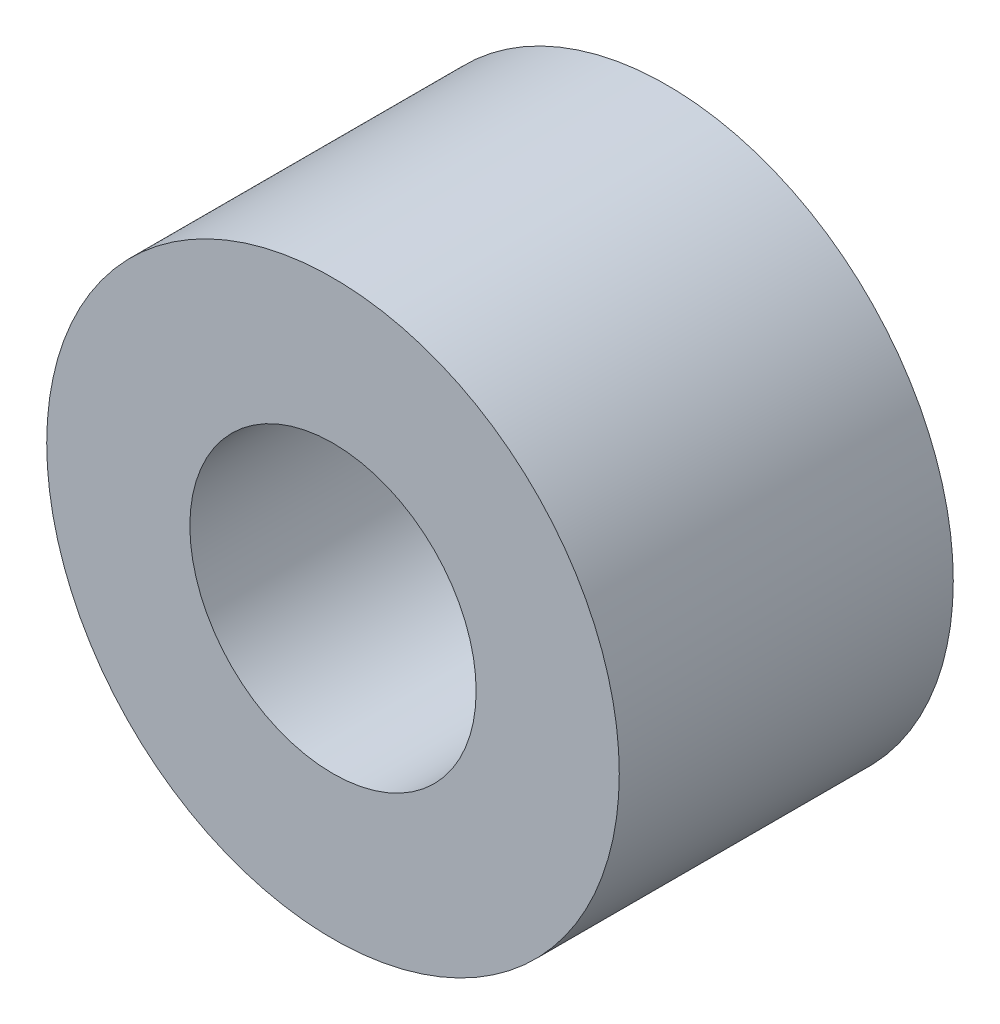
ISO-10303-21;
HEADER;
FILE_DESCRIPTION(('STEP AP214'),'2;1');
FILE_NAME('part.step','',(''),(''),'','','');
FILE_SCHEMA(('AUTOMOTIVE_DESIGN { 1 0 10303 214 1 1 1 1 }'));
ENDSEC;
DATA;
#1=APPLICATION_CONTEXT('core data for automotive mechanical design processes');
#2=APPLICATION_PROTOCOL_DEFINITION('international standard','automotive_design',2000,#1);
#3=PRODUCT_CONTEXT('',#1,'mechanical');
#4=PRODUCT('Part','Part','',(#3));
#5=PRODUCT_RELATED_PRODUCT_CATEGORY('part','',(#4));
#6=PRODUCT_DEFINITION_FORMATION('','',#4);
#7=PRODUCT_DEFINITION_CONTEXT('part definition',#1,'design');
#8=PRODUCT_DEFINITION('design','',#6,#7);
#9=PRODUCT_DEFINITION_SHAPE('','',#8);
#10=(LENGTH_UNIT() NAMED_UNIT(*) SI_UNIT(.MILLI.,.METRE.));
#11=(NAMED_UNIT(*) PLANE_ANGLE_UNIT() SI_UNIT($,.RADIAN.));
#12=(NAMED_UNIT(*) SI_UNIT($,.STERADIAN.) SOLID_ANGLE_UNIT());
#13=UNCERTAINTY_MEASURE_WITH_UNIT(LENGTH_MEASURE(1.E-05),#10,'distance_accuracy_value','');
#14=(GEOMETRIC_REPRESENTATION_CONTEXT(3) GLOBAL_UNCERTAINTY_ASSIGNED_CONTEXT((#13)) GLOBAL_UNIT_ASSIGNED_CONTEXT((#10,
#11,#12)) REPRESENTATION_CONTEXT('',''));
#15=CARTESIAN_POINT('',(0.,0.,0.));
#16=DIRECTION('',(0.,0.,1.));
#17=DIRECTION('',(1.,0.,0.));
#18=AXIS2_PLACEMENT_3D('',#15,#16,#17);
#19=CARTESIAN_POINT('',(7.99999999999999,30.,10.));
#20=DIRECTION('',(0.,0.,1.));
#21=DIRECTION('',(1.,0.,0.));
#22=AXIS2_PLACEMENT_3D('',#19,#20,#21);
#23=PLANE('',#22);
#24=CARTESIAN_POINT('',(7.99999999999999,30.,10.));
#25=DIRECTION('',(0.,0.,1.));
#26=DIRECTION('',(1.,0.,0.));
#27=AXIS2_PLACEMENT_3D('',#24,#25,#26);
#28=CIRCLE('',#27,6.00000000000001);
#29=CARTESIAN_POINT('',(14.,30.,10.));
#30=VERTEX_POINT('',#29);
#31=EDGE_CURVE('E10',#30,#30,#28,.T.);
#32=ORIENTED_EDGE('',*,*,#31,.T.);
#33=EDGE_LOOP('',(#32));
#34=FACE_BOUND('',#33,.T.);
#35=CARTESIAN_POINT('',(7.99999999999999,30.,10.));
#36=DIRECTION('',(0.,0.,1.));
#37=DIRECTION('',(1.,0.,0.));
#38=AXIS2_PLACEMENT_3D('',#35,#36,#37);
#39=CIRCLE('',#38,3.);
#40=CARTESIAN_POINT('',(11.,30.,10.));
#41=VERTEX_POINT('',#40);
#42=EDGE_CURVE('E46',#41,#41,#39,.T.);
#43=ORIENTED_EDGE('',*,*,#42,.F.);
#44=EDGE_LOOP('',(#43));
#45=FACE_BOUND('',#44,.T.);
#46=ADVANCED_FACE('F35',(#34,#45),#23,.T.);
#47=CARTESIAN_POINT('',(7.99999999999999,30.,3.));
#48=DIRECTION('',(0.,0.,1.));
#49=DIRECTION('',(1.,0.,0.));
#50=AXIS2_PLACEMENT_3D('',#47,#48,#49);
#51=PLANE('',#50);
#52=CARTESIAN_POINT('',(7.99999999999999,30.,3.));
#53=DIRECTION('',(0.,0.,1.));
#54=DIRECTION('',(1.,0.,0.));
#55=AXIS2_PLACEMENT_3D('',#52,#53,#54);
#56=CIRCLE('',#55,6.00000000000001);
#57=CARTESIAN_POINT('',(14.,30.,3.));
#58=VERTEX_POINT('',#57);
#59=EDGE_CURVE('E39',#58,#58,#56,.T.);
#60=ORIENTED_EDGE('',*,*,#59,.F.);
#61=EDGE_LOOP('',(#60));
#62=FACE_BOUND('',#61,.T.);
#63=CARTESIAN_POINT('',(7.99999999999999,30.,3.));
#64=DIRECTION('',(0.,0.,1.));
#65=DIRECTION('',(1.,0.,0.));
#66=AXIS2_PLACEMENT_3D('',#63,#64,#65);
#67=CIRCLE('',#66,3.);
#68=CARTESIAN_POINT('',(11.,30.,3.));
#69=VERTEX_POINT('',#68);
#70=EDGE_CURVE('E48',#69,#69,#67,.T.);
#71=ORIENTED_EDGE('',*,*,#70,.T.);
#72=EDGE_LOOP('',(#71));
#73=FACE_BOUND('',#72,.T.);
#74=ADVANCED_FACE('F58',(#62,#73),#51,.F.);
#75=CARTESIAN_POINT('',(7.99999999999999,30.,10.));
#76=DIRECTION('',(0.,0.,-1.));
#77=DIRECTION('',(-1.,0.,0.));
#78=AXIS2_PLACEMENT_3D('',#75,#76,#77);
#79=CYLINDRICAL_SURFACE('',#78,6.00000000000001);
#80=ORIENTED_EDGE('',*,*,#31,.F.);
#81=EDGE_LOOP('',(#80));
#82=FACE_BOUND('',#81,.T.);
#83=ORIENTED_EDGE('',*,*,#59,.T.);
#84=EDGE_LOOP('',(#83));
#85=FACE_BOUND('',#84,.T.);
#86=ADVANCED_FACE('F37',(#82,#85),#79,.T.);
#87=CARTESIAN_POINT('',(7.99999999999999,30.,10.));
#88=DIRECTION('',(0.,0.,-1.));
#89=DIRECTION('',(-1.,0.,0.));
#90=AXIS2_PLACEMENT_3D('',#87,#88,#89);
#91=CYLINDRICAL_SURFACE('',#90,3.);
#92=ORIENTED_EDGE('',*,*,#42,.T.);
#93=EDGE_LOOP('',(#92));
#94=FACE_BOUND('',#93,.T.);
#95=ORIENTED_EDGE('',*,*,#70,.F.);
#96=EDGE_LOOP('',(#95));
#97=FACE_BOUND('',#96,.T.);
#98=ADVANCED_FACE('F54',(#94,#97),#91,.F.);
#99=CLOSED_SHELL('',(#46,#74,#86,#98));
#100=MANIFOLD_SOLID_BREP('B2',#99);
#101=ADVANCED_BREP_SHAPE_REPRESENTATION('',(#18,#100),#14);
#102=SHAPE_DEFINITION_REPRESENTATION(#9,#101);
ENDSEC;
END-ISO-10303-21;
